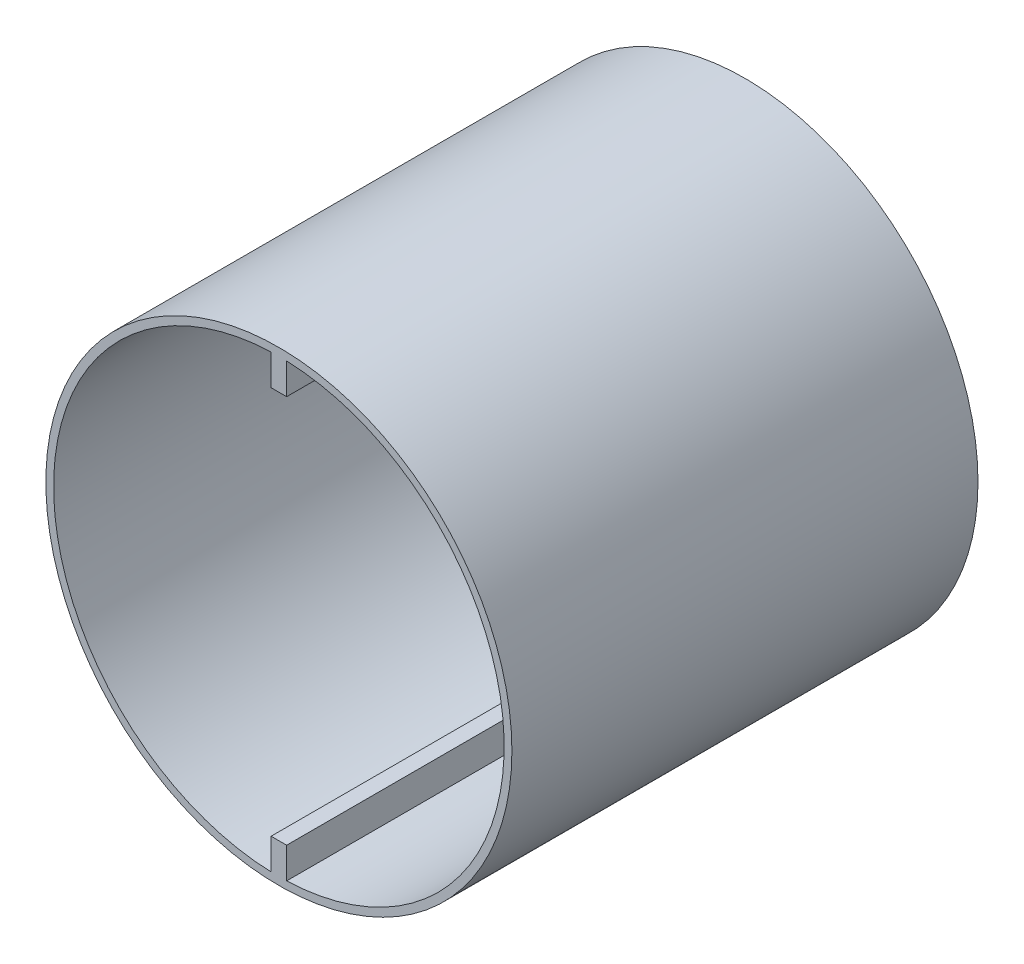
ISO-10303-21;
HEADER;
FILE_DESCRIPTION(('STEP AP214'),'2;1');
FILE_NAME('part.step','',(''),(''),'','','');
FILE_SCHEMA(('AUTOMOTIVE_DESIGN { 1 0 10303 214 1 1 1 1 }'));
ENDSEC;
DATA;
#1=APPLICATION_CONTEXT('core data for automotive mechanical design processes');
#2=APPLICATION_PROTOCOL_DEFINITION('international standard','automotive_design',2000,#1);
#3=PRODUCT_CONTEXT('',#1,'mechanical');
#4=PRODUCT('Part','Part','',(#3));
#5=PRODUCT_RELATED_PRODUCT_CATEGORY('part','',(#4));
#6=PRODUCT_DEFINITION_FORMATION('','',#4);
#7=PRODUCT_DEFINITION_CONTEXT('part definition',#1,'design');
#8=PRODUCT_DEFINITION('design','',#6,#7);
#9=PRODUCT_DEFINITION_SHAPE('','',#8);
#10=(LENGTH_UNIT() NAMED_UNIT(*) SI_UNIT(.MILLI.,.METRE.));
#11=(NAMED_UNIT(*) PLANE_ANGLE_UNIT() SI_UNIT($,.RADIAN.));
#12=(NAMED_UNIT(*) SI_UNIT($,.STERADIAN.) SOLID_ANGLE_UNIT());
#13=UNCERTAINTY_MEASURE_WITH_UNIT(LENGTH_MEASURE(1.E-05),#10,'distance_accuracy_value','');
#14=(GEOMETRIC_REPRESENTATION_CONTEXT(3) GLOBAL_UNCERTAINTY_ASSIGNED_CONTEXT((#13)) GLOBAL_UNIT_ASSIGNED_CONTEXT((#10,
#11,#12)) REPRESENTATION_CONTEXT('',''));
#15=CARTESIAN_POINT('',(0.,0.,0.));
#16=DIRECTION('',(0.,0.,1.));
#17=DIRECTION('',(1.,0.,0.));
#18=AXIS2_PLACEMENT_3D('',#15,#16,#17);
#19=CARTESIAN_POINT('',(0.,0.,60.));
#20=DIRECTION('',(0.,0.,-1.));
#21=DIRECTION('',(-1.,0.,0.));
#22=AXIS2_PLACEMENT_3D('',#19,#20,#21);
#23=CYLINDRICAL_SURFACE('',#22,3.5);
#24=CARTESIAN_POINT('',(0.,0.,33.));
#25=DIRECTION('',(0.,0.,1.));
#26=DIRECTION('',(1.,0.,0.));
#27=AXIS2_PLACEMENT_3D('',#24,#25,#26);
#28=CIRCLE('',#27,3.5);
#29=CARTESIAN_POINT('',(-1.,3.35410196624968,33.));
#30=VERTEX_POINT('',#29);
#31=CARTESIAN_POINT('',(-1.00000000000001,-3.35410196624968,33.));
#32=VERTEX_POINT('',#31);
#33=EDGE_CURVE('E202',#30,#32,#28,.T.);
#34=ORIENTED_EDGE('',*,*,#33,.F.);
#35=DIRECTION('',(0.,0.,-1.));
#36=VECTOR('',#35,1.);
#37=CARTESIAN_POINT('',(-1.,3.35410196624968,60.));
#38=LINE('',#37,#36);
#39=CARTESIAN_POINT('',(-1.,3.35410196624968,18.));
#40=VERTEX_POINT('',#39);
#41=EDGE_CURVE('E247',#30,#40,#38,.T.);
#42=ORIENTED_EDGE('',*,*,#41,.T.);
#43=CARTESIAN_POINT('',(-1.,3.35410196624968,0.));
#44=VERTEX_POINT('',#43);
#45=EDGE_CURVE('E250',#40,#44,#38,.T.);
#46=ORIENTED_EDGE('',*,*,#45,.T.);
#47=CARTESIAN_POINT('',(0.,0.,0.));
#48=DIRECTION('',(0.,0.,1.));
#49=DIRECTION('',(1.,0.,0.));
#50=AXIS2_PLACEMENT_3D('',#47,#48,#49);
#51=CIRCLE('',#50,3.5);
#52=CARTESIAN_POINT('',(-1.,-3.35410196624968,0.));
#53=VERTEX_POINT('',#52);
#54=EDGE_CURVE('E214',#44,#53,#51,.T.);
#55=ORIENTED_EDGE('',*,*,#54,.T.);
#56=DIRECTION('',(0.,0.,-1.));
#57=VECTOR('',#56,1.);
#58=CARTESIAN_POINT('',(-1.,-3.35410196624968,60.));
#59=LINE('',#58,#57);
#60=CARTESIAN_POINT('',(-1.,-3.35410196624968,18.));
#61=VERTEX_POINT('',#60);
#62=EDGE_CURVE('E186',#61,#53,#59,.T.);
#63=ORIENTED_EDGE('',*,*,#62,.F.);
#64=EDGE_CURVE('E150',#32,#61,#59,.T.);
#65=ORIENTED_EDGE('',*,*,#64,.F.);
#66=EDGE_LOOP('',(#34,#42,#46,#55,#63,#65));
#67=FACE_BOUND('',#66,.T.);
#68=ADVANCED_FACE('F41',(#67),#23,.T.);
#69=CARTESIAN_POINT('',(0.,0.,60.));
#70=DIRECTION('',(0.,0.,-1.));
#71=DIRECTION('',(-1.,0.,0.));
#72=AXIS2_PLACEMENT_3D('',#69,#70,#71);
#73=CYLINDRICAL_SURFACE('',#72,3.5);
#74=CARTESIAN_POINT('',(0.,0.,33.));
#75=DIRECTION('',(0.,0.,1.));
#76=DIRECTION('',(1.,0.,0.));
#77=AXIS2_PLACEMENT_3D('',#74,#75,#76);
#78=CIRCLE('',#77,3.5);
#79=CARTESIAN_POINT('',(1.,-3.35410196624968,33.));
#80=VERTEX_POINT('',#79);
#81=CARTESIAN_POINT('',(1.,3.35410196624968,33.));
#82=VERTEX_POINT('',#81);
#83=EDGE_CURVE('E184',#80,#82,#78,.T.);
#84=ORIENTED_EDGE('',*,*,#83,.F.);
#85=DIRECTION('',(0.,0.,-1.));
#86=VECTOR('',#85,1.);
#87=CARTESIAN_POINT('',(1.,-3.35410196624968,60.));
#88=LINE('',#87,#86);
#89=CARTESIAN_POINT('',(1.,-3.35410196624968,18.));
#90=VERTEX_POINT('',#89);
#91=EDGE_CURVE('E147',#80,#90,#88,.T.);
#92=ORIENTED_EDGE('',*,*,#91,.T.);
#93=CARTESIAN_POINT('',(1.,-3.35410196624968,0.));
#94=VERTEX_POINT('',#93);
#95=EDGE_CURVE('E170',#90,#94,#88,.T.);
#96=ORIENTED_EDGE('',*,*,#95,.T.);
#97=CARTESIAN_POINT('',(0.,0.,0.));
#98=DIRECTION('',(0.,0.,1.));
#99=DIRECTION('',(1.,0.,0.));
#100=AXIS2_PLACEMENT_3D('',#97,#98,#99);
#101=CIRCLE('',#100,3.5);
#102=CARTESIAN_POINT('',(1.,3.35410196624968,0.));
#103=VERTEX_POINT('',#102);
#104=EDGE_CURVE('E233',#94,#103,#101,.T.);
#105=ORIENTED_EDGE('',*,*,#104,.T.);
#106=DIRECTION('',(0.,0.,-1.));
#107=VECTOR('',#106,1.);
#108=CARTESIAN_POINT('',(1.,3.35410196624968,60.));
#109=LINE('',#108,#107);
#110=CARTESIAN_POINT('',(1.,3.35410196624968,18.));
#111=VERTEX_POINT('',#110);
#112=EDGE_CURVE('E249',#111,#103,#109,.T.);
#113=ORIENTED_EDGE('',*,*,#112,.F.);
#114=EDGE_CURVE('E178',#82,#111,#109,.T.);
#115=ORIENTED_EDGE('',*,*,#114,.F.);
#116=EDGE_LOOP('',(#84,#92,#96,#105,#113,#115));
#117=FACE_BOUND('',#116,.T.);
#118=ADVANCED_FACE('F181',(#117),#73,.T.);
#119=CARTESIAN_POINT('',(-1.,-3.35410196624968,60.));
#120=DIRECTION('',(1.,0.,0.));
#121=DIRECTION('',(0.,1.,0.));
#122=AXIS2_PLACEMENT_3D('',#119,#120,#121);
#123=PLANE('',#122);
#124=DIRECTION('',(0.,0.,-1.));
#125=VECTOR('',#124,1.);
#126=CARTESIAN_POINT('',(-0.999999999999997,-25.,60.));
#127=LINE('',#126,#125);
#128=CARTESIAN_POINT('',(-0.999999999999997,-25.,60.));
#129=VERTEX_POINT('',#128);
#130=CARTESIAN_POINT('',(-0.999999999999997,-25.,18.));
#131=VERTEX_POINT('',#130);
#132=EDGE_CURVE('E305',#129,#131,#127,.T.);
#133=ORIENTED_EDGE('',*,*,#132,.T.);
#134=DIRECTION('',(0.,1.,0.));
#135=VECTOR('',#134,1.);
#136=CARTESIAN_POINT('',(-1.,-3.35410196624968,18.));
#137=LINE('',#136,#135);
#138=EDGE_CURVE('E221',#131,#61,#137,.T.);
#139=ORIENTED_EDGE('',*,*,#138,.T.);
#140=ORIENTED_EDGE('',*,*,#62,.T.);
#141=DIRECTION('',(0.,-1.,0.));
#142=VECTOR('',#141,1.);
#143=CARTESIAN_POINT('',(-1.,-3.35410196624968,0.));
#144=LINE('',#143,#142);
#145=CARTESIAN_POINT('',(-0.999999999999996,-28.9827534923789,0.));
#146=VERTEX_POINT('',#145);
#147=EDGE_CURVE('E219',#53,#146,#144,.T.);
#148=ORIENTED_EDGE('',*,*,#147,.T.);
#149=DIRECTION('',(0.,0.,1.));
#150=VECTOR('',#149,1.);
#151=CARTESIAN_POINT('',(-0.999999999999996,-28.9827534923789,0.));
#152=LINE('',#151,#150);
#153=CARTESIAN_POINT('',(-0.999999999999996,-28.9827534923789,60.));
#154=VERTEX_POINT('',#153);
#155=EDGE_CURVE('E235',#154,#146,#152,.F.);
#156=ORIENTED_EDGE('',*,*,#155,.F.);
#157=DIRECTION('',(0.,-1.,0.));
#158=VECTOR('',#157,1.);
#159=CARTESIAN_POINT('',(-1.,-3.35410196624968,60.));
#160=LINE('',#159,#158);
#161=EDGE_CURVE('E63',#129,#154,#160,.T.);
#162=ORIENTED_EDGE('',*,*,#161,.F.);
#163=EDGE_LOOP('',(#133,#139,#140,#148,#156,#162));
#164=FACE_BOUND('',#163,.T.);
#165=ADVANCED_FACE('F218',(#164),#123,.F.);
#166=CARTESIAN_POINT('',(1.,-15.0064685884307,60.));
#167=DIRECTION('',(-1.,0.,0.));
#168=DIRECTION('',(0.,0.,1.));
#169=AXIS2_PLACEMENT_3D('',#166,#167,#168);
#170=PLANE('',#169);
#171=ORIENTED_EDGE('',*,*,#95,.F.);
#172=DIRECTION('',(0.,1.,0.));
#173=VECTOR('',#172,1.);
#174=CARTESIAN_POINT('',(1.,-25.,18.));
#175=LINE('',#174,#173);
#176=CARTESIAN_POINT('',(1.,-25.,18.));
#177=VERTEX_POINT('',#176);
#178=EDGE_CURVE('E158',#177,#90,#175,.T.);
#179=ORIENTED_EDGE('',*,*,#178,.F.);
#180=DIRECTION('',(0.,0.,-1.));
#181=VECTOR('',#180,1.);
#182=CARTESIAN_POINT('',(1.,-25.,18.));
#183=LINE('',#182,#181);
#184=CARTESIAN_POINT('',(1.,-25.,60.));
#185=VERTEX_POINT('',#184);
#186=EDGE_CURVE('E155',#185,#177,#183,.T.);
#187=ORIENTED_EDGE('',*,*,#186,.F.);
#188=DIRECTION('',(0.,1.,0.));
#189=VECTOR('',#188,1.);
#190=CARTESIAN_POINT('',(1.,-29.5,60.));
#191=LINE('',#190,#189);
#192=CARTESIAN_POINT('',(1.,-28.9827534923789,60.));
#193=VERTEX_POINT('',#192);
#194=EDGE_CURVE('E258',#193,#185,#191,.T.);
#195=ORIENTED_EDGE('',*,*,#194,.F.);
#196=DIRECTION('',(0.,0.,1.));
#197=VECTOR('',#196,1.);
#198=CARTESIAN_POINT('',(1.,-28.9827534923789,0.));
#199=LINE('',#198,#197);
#200=CARTESIAN_POINT('',(1.,-28.9827534923789,0.));
#201=VERTEX_POINT('',#200);
#202=EDGE_CURVE('E268',#201,#193,#199,.T.);
#203=ORIENTED_EDGE('',*,*,#202,.F.);
#204=DIRECTION('',(0.,1.,0.));
#205=VECTOR('',#204,1.);
#206=CARTESIAN_POINT('',(1.,-15.0064685884307,0.));
#207=LINE('',#206,#205);
#208=EDGE_CURVE('E173',#201,#94,#207,.T.);
#209=ORIENTED_EDGE('',*,*,#208,.T.);
#210=EDGE_LOOP('',(#171,#179,#187,#195,#203,#209));
#211=FACE_BOUND('',#210,.T.);
#212=ADVANCED_FACE('F171',(#211),#170,.F.);
#213=CARTESIAN_POINT('',(1.,3.35410196624968,60.));
#214=DIRECTION('',(-1.,0.,0.));
#215=DIRECTION('',(0.,-1.,0.));
#216=AXIS2_PLACEMENT_3D('',#213,#214,#215);
#217=PLANE('',#216);
#218=DIRECTION('',(0.,1.,0.));
#219=VECTOR('',#218,1.);
#220=CARTESIAN_POINT('',(1.,3.35410196624968,60.));
#221=LINE('',#220,#219);
#222=CARTESIAN_POINT('',(1.,25.,60.));
#223=VERTEX_POINT('',#222);
#224=CARTESIAN_POINT('',(1.,28.9827534923789,60.));
#225=VERTEX_POINT('',#224);
#226=EDGE_CURVE('E56',#223,#225,#221,.T.);
#227=ORIENTED_EDGE('',*,*,#226,.F.);
#228=DIRECTION('',(0.,0.,1.));
#229=VECTOR('',#228,1.);
#230=CARTESIAN_POINT('',(1.,25.,18.));
#231=LINE('',#230,#229);
#232=CARTESIAN_POINT('',(1.,25.,18.));
#233=VERTEX_POINT('',#232);
#234=EDGE_CURVE('E316',#233,#223,#231,.T.);
#235=ORIENTED_EDGE('',*,*,#234,.F.);
#236=DIRECTION('',(0.,1.,0.));
#237=VECTOR('',#236,1.);
#238=CARTESIAN_POINT('',(1.,25.,18.));
#239=LINE('',#238,#237);
#240=EDGE_CURVE('E324',#111,#233,#239,.T.);
#241=ORIENTED_EDGE('',*,*,#240,.F.);
#242=ORIENTED_EDGE('',*,*,#112,.T.);
#243=DIRECTION('',(0.,1.,0.));
#244=VECTOR('',#243,1.);
#245=CARTESIAN_POINT('',(1.,3.35410196624968,0.));
#246=LINE('',#245,#244);
#247=CARTESIAN_POINT('',(1.,28.9827534923789,0.));
#248=VERTEX_POINT('',#247);
#249=EDGE_CURVE('E241',#103,#248,#246,.T.);
#250=ORIENTED_EDGE('',*,*,#249,.T.);
#251=DIRECTION('',(0.,0.,1.));
#252=VECTOR('',#251,1.);
#253=CARTESIAN_POINT('',(1.,28.9827534923789,0.));
#254=LINE('',#253,#252);
#255=EDGE_CURVE('E272',#225,#248,#254,.F.);
#256=ORIENTED_EDGE('',*,*,#255,.F.);
#257=EDGE_LOOP('',(#227,#235,#241,#242,#250,#256));
#258=FACE_BOUND('',#257,.T.);
#259=ADVANCED_FACE('F346',(#258),#217,.F.);
#260=CARTESIAN_POINT('',(-1.,29.5,60.));
#261=DIRECTION('',(1.,0.,0.));
#262=DIRECTION('',(0.,1.,0.));
#263=AXIS2_PLACEMENT_3D('',#260,#261,#262);
#264=PLANE('',#263);
#265=DIRECTION('',(0.,1.,0.));
#266=VECTOR('',#265,1.);
#267=CARTESIAN_POINT('',(-1.,29.5,18.));
#268=LINE('',#267,#266);
#269=CARTESIAN_POINT('',(-1.,25.,18.));
#270=VERTEX_POINT('',#269);
#271=EDGE_CURVE('E11',#40,#270,#268,.T.);
#272=ORIENTED_EDGE('',*,*,#271,.T.);
#273=DIRECTION('',(0.,0.,1.));
#274=VECTOR('',#273,1.);
#275=CARTESIAN_POINT('',(-1.,25.,60.));
#276=LINE('',#275,#274);
#277=CARTESIAN_POINT('',(-1.,25.,60.));
#278=VERTEX_POINT('',#277);
#279=EDGE_CURVE('E308',#270,#278,#276,.T.);
#280=ORIENTED_EDGE('',*,*,#279,.T.);
#281=DIRECTION('',(0.,-1.,0.));
#282=VECTOR('',#281,1.);
#283=CARTESIAN_POINT('',(-1.,29.5,60.));
#284=LINE('',#283,#282);
#285=CARTESIAN_POINT('',(-1.,28.9827534923789,60.));
#286=VERTEX_POINT('',#285);
#287=EDGE_CURVE('E253',#286,#278,#284,.T.);
#288=ORIENTED_EDGE('',*,*,#287,.F.);
#289=DIRECTION('',(0.,0.,1.));
#290=VECTOR('',#289,1.);
#291=CARTESIAN_POINT('',(-1.,28.9827534923789,0.));
#292=LINE('',#291,#290);
#293=CARTESIAN_POINT('',(-1.,28.9827534923789,0.));
#294=VERTEX_POINT('',#293);
#295=EDGE_CURVE('E276',#294,#286,#292,.T.);
#296=ORIENTED_EDGE('',*,*,#295,.F.);
#297=DIRECTION('',(0.,-1.,0.));
#298=VECTOR('',#297,1.);
#299=CARTESIAN_POINT('',(-1.,29.5,0.));
#300=LINE('',#299,#298);
#301=EDGE_CURVE('E244',#294,#44,#300,.T.);
#302=ORIENTED_EDGE('',*,*,#301,.T.);
#303=ORIENTED_EDGE('',*,*,#45,.F.);
#304=EDGE_LOOP('',(#272,#280,#288,#296,#302,#303));
#305=FACE_BOUND('',#304,.T.);
#306=ADVANCED_FACE('F382',(#305),#264,.F.);
#307=CARTESIAN_POINT('',(0.,0.,60.));
#308=DIRECTION('',(0.,0.,1.));
#309=DIRECTION('',(1.,0.,0.));
#310=AXIS2_PLACEMENT_3D('',#307,#308,#309);
#311=PLANE('',#310);
#312=DIRECTION('',(1.,0.,0.));
#313=VECTOR('',#312,1.);
#314=CARTESIAN_POINT('',(-3.99999999999997,-25.,60.));
#315=LINE('',#314,#313);
#316=EDGE_CURVE('E154',#129,#185,#315,.T.);
#317=ORIENTED_EDGE('',*,*,#316,.F.);
#318=ORIENTED_EDGE('',*,*,#161,.T.);
#319=CARTESIAN_POINT('',(0.,0.,60.));
#320=DIRECTION('',(0.,0.,1.));
#321=DIRECTION('',(1.,0.,0.));
#322=AXIS2_PLACEMENT_3D('',#319,#320,#321);
#323=CIRCLE('',#322,29.);
#324=EDGE_CURVE('E291',#286,#154,#323,.T.);
#325=ORIENTED_EDGE('',*,*,#324,.F.);
#326=ORIENTED_EDGE('',*,*,#287,.T.);
#327=DIRECTION('',(1.,0.,0.));
#328=VECTOR('',#327,1.);
#329=CARTESIAN_POINT('',(-3.99999999999997,25.,60.));
#330=LINE('',#329,#328);
#331=EDGE_CURVE('E167',#278,#223,#330,.T.);
#332=ORIENTED_EDGE('',*,*,#331,.T.);
#333=ORIENTED_EDGE('',*,*,#226,.T.);
#334=EDGE_CURVE('E208',#193,#225,#323,.T.);
#335=ORIENTED_EDGE('',*,*,#334,.F.);
#336=ORIENTED_EDGE('',*,*,#194,.T.);
#337=EDGE_LOOP('',(#317,#318,#325,#326,#332,#333,#335,#336));
#338=FACE_BOUND('',#337,.T.);
#339=CARTESIAN_POINT('',(0.,0.,60.));
#340=DIRECTION('',(0.,0.,1.));
#341=DIRECTION('',(1.,0.,0.));
#342=AXIS2_PLACEMENT_3D('',#339,#340,#341);
#343=CIRCLE('',#342,30.);
#344=CARTESIAN_POINT('',(30.,0.,60.));
#345=VERTEX_POINT('',#344);
#346=EDGE_CURVE('E281',#345,#345,#343,.T.);
#347=ORIENTED_EDGE('',*,*,#346,.T.);
#348=EDGE_LOOP('',(#347));
#349=FACE_BOUND('',#348,.T.);
#350=ADVANCED_FACE('F335',(#338,#349),#311,.T.);
#351=CARTESIAN_POINT('',(0.,0.,0.));
#352=DIRECTION('',(0.,0.,1.));
#353=DIRECTION('',(1.,0.,0.));
#354=AXIS2_PLACEMENT_3D('',#351,#352,#353);
#355=PLANE('',#354);
#356=ORIENTED_EDGE('',*,*,#208,.F.);
#357=CARTESIAN_POINT('',(0.,0.,0.));
#358=DIRECTION('',(0.,0.,1.));
#359=DIRECTION('',(1.,0.,0.));
#360=AXIS2_PLACEMENT_3D('',#357,#358,#359);
#361=CIRCLE('',#360,29.);
#362=EDGE_CURVE('E292',#201,#248,#361,.T.);
#363=ORIENTED_EDGE('',*,*,#362,.T.);
#364=ORIENTED_EDGE('',*,*,#249,.F.);
#365=ORIENTED_EDGE('',*,*,#104,.F.);
#366=EDGE_LOOP('',(#356,#363,#364,#365));
#367=FACE_BOUND('',#366,.T.);
#368=EDGE_CURVE('E228',#294,#146,#361,.T.);
#369=ORIENTED_EDGE('',*,*,#368,.T.);
#370=ORIENTED_EDGE('',*,*,#147,.F.);
#371=ORIENTED_EDGE('',*,*,#54,.F.);
#372=ORIENTED_EDGE('',*,*,#301,.F.);
#373=EDGE_LOOP('',(#369,#370,#371,#372));
#374=FACE_BOUND('',#373,.T.);
#375=CARTESIAN_POINT('',(0.,0.,0.));
#376=DIRECTION('',(0.,0.,1.));
#377=DIRECTION('',(1.,0.,0.));
#378=AXIS2_PLACEMENT_3D('',#375,#376,#377);
#379=CIRCLE('',#378,30.);
#380=CARTESIAN_POINT('',(30.,0.,0.));
#381=VERTEX_POINT('',#380);
#382=EDGE_CURVE('E280',#381,#381,#379,.T.);
#383=ORIENTED_EDGE('',*,*,#382,.F.);
#384=EDGE_LOOP('',(#383));
#385=FACE_BOUND('',#384,.T.);
#386=ADVANCED_FACE('F224',(#367,#374,#385),#355,.F.);
#387=CARTESIAN_POINT('',(0.,0.,0.));
#388=DIRECTION('',(0.,0.,1.));
#389=DIRECTION('',(1.,0.,0.));
#390=AXIS2_PLACEMENT_3D('',#387,#388,#389);
#391=CYLINDRICAL_SURFACE('',#390,29.);
#392=ORIENTED_EDGE('',*,*,#324,.T.);
#393=ORIENTED_EDGE('',*,*,#155,.T.);
#394=ORIENTED_EDGE('',*,*,#368,.F.);
#395=ORIENTED_EDGE('',*,*,#295,.T.);
#396=EDGE_LOOP('',(#392,#393,#394,#395));
#397=FACE_BOUND('',#396,.T.);
#398=ADVANCED_FACE('F393',(#397),#391,.F.);
#399=ORIENTED_EDGE('',*,*,#362,.F.);
#400=ORIENTED_EDGE('',*,*,#202,.T.);
#401=ORIENTED_EDGE('',*,*,#334,.T.);
#402=ORIENTED_EDGE('',*,*,#255,.T.);
#403=EDGE_LOOP('',(#399,#400,#401,#402));
#404=FACE_BOUND('',#403,.T.);
#405=ADVANCED_FACE('F339',(#404),#391,.F.);
#406=CARTESIAN_POINT('',(0.,0.,0.));
#407=DIRECTION('',(0.,0.,1.));
#408=DIRECTION('',(1.,0.,0.));
#409=AXIS2_PLACEMENT_3D('',#406,#407,#408);
#410=CYLINDRICAL_SURFACE('',#409,30.);
#411=ORIENTED_EDGE('',*,*,#382,.T.);
#412=EDGE_LOOP('',(#411));
#413=FACE_BOUND('',#412,.T.);
#414=ORIENTED_EDGE('',*,*,#346,.F.);
#415=EDGE_LOOP('',(#414));
#416=FACE_BOUND('',#415,.T.);
#417=ADVANCED_FACE('F395',(#413,#416),#410,.T.);
#418=CARTESIAN_POINT('',(0.,0.,33.));
#419=DIRECTION('',(0.,0.,1.));
#420=DIRECTION('',(1.,0.,0.));
#421=AXIS2_PLACEMENT_3D('',#418,#419,#420);
#422=PLANE('',#421);
#423=DIRECTION('',(-1.,0.,0.));
#424=VECTOR('',#423,1.);
#425=CARTESIAN_POINT('',(0.,-3.35410196624968,33.));
#426=LINE('',#425,#424);
#427=EDGE_CURVE('E49',#80,#32,#426,.T.);
#428=ORIENTED_EDGE('',*,*,#427,.F.);
#429=ORIENTED_EDGE('',*,*,#83,.T.);
#430=DIRECTION('',(1.,0.,0.));
#431=VECTOR('',#430,1.);
#432=CARTESIAN_POINT('',(0.,3.35410196624968,33.));
#433=LINE('',#432,#431);
#434=EDGE_CURVE('E195',#30,#82,#433,.T.);
#435=ORIENTED_EDGE('',*,*,#434,.F.);
#436=ORIENTED_EDGE('',*,*,#33,.T.);
#437=EDGE_LOOP('',(#428,#429,#435,#436));
#438=FACE_BOUND('',#437,.T.);
#439=CARTESIAN_POINT('',(0.,0.,33.));
#440=DIRECTION('',(0.,0.,1.));
#441=DIRECTION('',(1.,0.,0.));
#442=AXIS2_PLACEMENT_3D('',#439,#440,#441);
#443=CIRCLE('',#442,2.225);
#444=CARTESIAN_POINT('',(2.225,0.,33.));
#445=VERTEX_POINT('',#444);
#446=EDGE_CURVE('E296',#445,#445,#443,.T.);
#447=ORIENTED_EDGE('',*,*,#446,.F.);
#448=EDGE_LOOP('',(#447));
#449=FACE_BOUND('',#448,.T.);
#450=ADVANCED_FACE('F203',(#438,#449),#422,.T.);
#451=CARTESIAN_POINT('',(0.,0.,31.));
#452=DIRECTION('',(0.,0.,1.));
#453=DIRECTION('',(1.,0.,0.));
#454=AXIS2_PLACEMENT_3D('',#451,#452,#453);
#455=CYLINDRICAL_SURFACE('',#454,2.225);
#456=CARTESIAN_POINT('',(0.,0.,31.));
#457=DIRECTION('',(0.,0.,1.));
#458=DIRECTION('',(1.,0.,0.));
#459=AXIS2_PLACEMENT_3D('',#456,#457,#458);
#460=CIRCLE('',#459,2.225);
#461=CARTESIAN_POINT('',(2.225,0.,31.));
#462=VERTEX_POINT('',#461);
#463=EDGE_CURVE('E209',#462,#462,#460,.T.);
#464=ORIENTED_EDGE('',*,*,#463,.F.);
#465=EDGE_LOOP('',(#464));
#466=FACE_BOUND('',#465,.T.);
#467=ORIENTED_EDGE('',*,*,#446,.T.);
#468=EDGE_LOOP('',(#467));
#469=FACE_BOUND('',#468,.T.);
#470=ADVANCED_FACE('F404',(#466,#469),#455,.F.);
#471=CARTESIAN_POINT('',(0.,0.,31.));
#472=DIRECTION('',(0.,0.,1.));
#473=DIRECTION('',(1.,0.,0.));
#474=AXIS2_PLACEMENT_3D('',#471,#472,#473);
#475=PLANE('',#474);
#476=ORIENTED_EDGE('',*,*,#463,.T.);
#477=EDGE_LOOP('',(#476));
#478=FACE_BOUND('',#477,.T.);
#479=ADVANCED_FACE('F364',(#478),#475,.T.);
#480=CARTESIAN_POINT('',(-3.99999999999997,25.,18.));
#481=DIRECTION('',(0.,0.,-1.));
#482=DIRECTION('',(0.,1.,0.));
#483=AXIS2_PLACEMENT_3D('',#480,#481,#482);
#484=PLANE('',#483);
#485=DIRECTION('',(1.,0.,0.));
#486=VECTOR('',#485,1.);
#487=CARTESIAN_POINT('',(-3.99999999999997,3.35410196624968,18.));
#488=LINE('',#487,#486);
#489=EDGE_CURVE('E312',#40,#111,#488,.T.);
#490=ORIENTED_EDGE('',*,*,#489,.T.);
#491=ORIENTED_EDGE('',*,*,#240,.T.);
#492=DIRECTION('',(1.,0.,0.));
#493=VECTOR('',#492,1.);
#494=CARTESIAN_POINT('',(-3.99999999999997,25.,18.));
#495=LINE('',#494,#493);
#496=EDGE_CURVE('E315',#270,#233,#495,.T.);
#497=ORIENTED_EDGE('',*,*,#496,.F.);
#498=ORIENTED_EDGE('',*,*,#271,.F.);
#499=EDGE_LOOP('',(#490,#491,#497,#498));
#500=FACE_BOUND('',#499,.T.);
#501=ADVANCED_FACE('F350',(#500),#484,.F.);
#502=CARTESIAN_POINT('',(-3.99999999999997,3.35410196624968,18.));
#503=DIRECTION('',(0.,-1.,0.));
#504=DIRECTION('',(0.,0.,-1.));
#505=AXIS2_PLACEMENT_3D('',#502,#503,#504);
#506=PLANE('',#505);
#507=ORIENTED_EDGE('',*,*,#434,.T.);
#508=ORIENTED_EDGE('',*,*,#114,.T.);
#509=ORIENTED_EDGE('',*,*,#489,.F.);
#510=ORIENTED_EDGE('',*,*,#41,.F.);
#511=EDGE_LOOP('',(#507,#508,#509,#510));
#512=FACE_BOUND('',#511,.T.);
#513=ADVANCED_FACE('F353',(#512),#506,.F.);
#514=CARTESIAN_POINT('',(-3.99999999999997,25.,18.));
#515=DIRECTION('',(0.,1.,0.));
#516=DIRECTION('',(-1.,0.,0.));
#517=AXIS2_PLACEMENT_3D('',#514,#515,#516);
#518=PLANE('',#517);
#519=ORIENTED_EDGE('',*,*,#496,.T.);
#520=ORIENTED_EDGE('',*,*,#234,.T.);
#521=ORIENTED_EDGE('',*,*,#331,.F.);
#522=ORIENTED_EDGE('',*,*,#279,.F.);
#523=EDGE_LOOP('',(#519,#520,#521,#522));
#524=FACE_BOUND('',#523,.T.);
#525=ADVANCED_FACE('F356',(#524),#518,.F.);
#526=CARTESIAN_POINT('',(-3.99999999999997,-25.,18.));
#527=DIRECTION('',(0.,0.,-1.));
#528=DIRECTION('',(0.,1.,0.));
#529=AXIS2_PLACEMENT_3D('',#526,#527,#528);
#530=PLANE('',#529);
#531=DIRECTION('',(1.,0.,0.));
#532=VECTOR('',#531,1.);
#533=CARTESIAN_POINT('',(-3.99999999999997,-25.,18.));
#534=LINE('',#533,#532);
#535=EDGE_CURVE('E162',#131,#177,#534,.T.);
#536=ORIENTED_EDGE('',*,*,#535,.T.);
#537=ORIENTED_EDGE('',*,*,#178,.T.);
#538=DIRECTION('',(1.,0.,0.));
#539=VECTOR('',#538,1.);
#540=CARTESIAN_POINT('',(-3.99999999999997,-3.35410196624968,18.));
#541=LINE('',#540,#539);
#542=EDGE_CURVE('E143',#61,#90,#541,.T.);
#543=ORIENTED_EDGE('',*,*,#542,.F.);
#544=ORIENTED_EDGE('',*,*,#138,.F.);
#545=EDGE_LOOP('',(#536,#537,#543,#544));
#546=FACE_BOUND('',#545,.T.);
#547=ADVANCED_FACE('F160',(#546),#530,.F.);
#548=CARTESIAN_POINT('',(-3.99999999999997,-3.35410196624968,18.));
#549=DIRECTION('',(0.,1.,0.));
#550=DIRECTION('',(0.,0.,1.));
#551=AXIS2_PLACEMENT_3D('',#548,#549,#550);
#552=PLANE('',#551);
#553=ORIENTED_EDGE('',*,*,#542,.T.);
#554=ORIENTED_EDGE('',*,*,#91,.F.);
#555=ORIENTED_EDGE('',*,*,#427,.T.);
#556=ORIENTED_EDGE('',*,*,#64,.T.);
#557=EDGE_LOOP('',(#553,#554,#555,#556));
#558=FACE_BOUND('',#557,.T.);
#559=ADVANCED_FACE('F145',(#558),#552,.F.);
#560=CARTESIAN_POINT('',(-3.99999999999997,-25.,18.));
#561=DIRECTION('',(0.,-1.,0.));
#562=DIRECTION('',(0.,0.,-1.));
#563=AXIS2_PLACEMENT_3D('',#560,#561,#562);
#564=PLANE('',#563);
#565=ORIENTED_EDGE('',*,*,#316,.T.);
#566=ORIENTED_EDGE('',*,*,#186,.T.);
#567=ORIENTED_EDGE('',*,*,#535,.F.);
#568=ORIENTED_EDGE('',*,*,#132,.F.);
#569=EDGE_LOOP('',(#565,#566,#567,#568));
#570=FACE_BOUND('',#569,.T.);
#571=ADVANCED_FACE('F334',(#570),#564,.F.);
#572=CLOSED_SHELL('',(#68,#118,#165,#212,#259,#306,#350,#386,#398,#405,#417,#450,#470,#479,#501,
#513,#525,#547,#559,#571));
#573=MANIFOLD_SOLID_BREP('B2',#572);
#574=ADVANCED_BREP_SHAPE_REPRESENTATION('',(#18,#573),#14);
#575=SHAPE_DEFINITION_REPRESENTATION(#9,#574);
ENDSEC;
END-ISO-10303-21;
